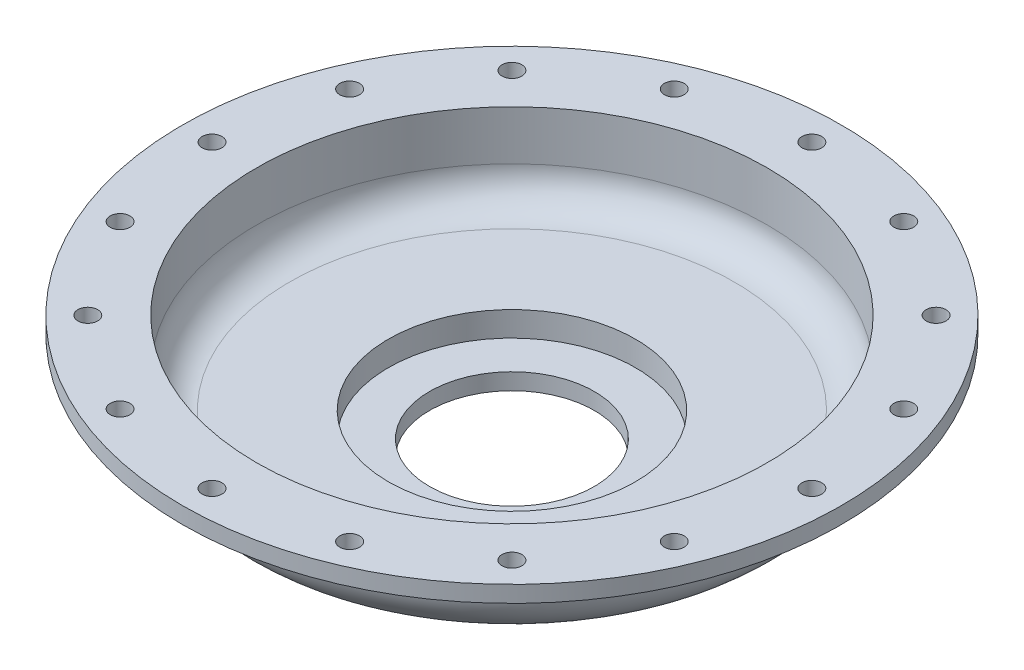
ISO-10303-21;
HEADER;
FILE_DESCRIPTION(('STEP AP214'),'2;1');
FILE_NAME('part.step','',(''),(''),'','','');
FILE_SCHEMA(('AUTOMOTIVE_DESIGN { 1 0 10303 214 1 1 1 1 }'));
ENDSEC;
DATA;
#1=APPLICATION_CONTEXT('core data for automotive mechanical design processes');
#2=APPLICATION_PROTOCOL_DEFINITION('international standard','automotive_design',2000,#1);
#3=PRODUCT_CONTEXT('',#1,'mechanical');
#4=PRODUCT('Part','Part','',(#3));
#5=PRODUCT_RELATED_PRODUCT_CATEGORY('part','',(#4));
#6=PRODUCT_DEFINITION_FORMATION('','',#4);
#7=PRODUCT_DEFINITION_CONTEXT('part definition',#1,'design');
#8=PRODUCT_DEFINITION('design','',#6,#7);
#9=PRODUCT_DEFINITION_SHAPE('','',#8);
#10=(LENGTH_UNIT() NAMED_UNIT(*) SI_UNIT(.MILLI.,.METRE.));
#11=(NAMED_UNIT(*) PLANE_ANGLE_UNIT() SI_UNIT($,.RADIAN.));
#12=(NAMED_UNIT(*) SI_UNIT($,.STERADIAN.) SOLID_ANGLE_UNIT());
#13=UNCERTAINTY_MEASURE_WITH_UNIT(LENGTH_MEASURE(1.E-05),#10,'distance_accuracy_value','');
#14=(GEOMETRIC_REPRESENTATION_CONTEXT(3) GLOBAL_UNCERTAINTY_ASSIGNED_CONTEXT((#13)) GLOBAL_UNIT_ASSIGNED_CONTEXT((#10,
#11,#12)) REPRESENTATION_CONTEXT('',''));
#15=CARTESIAN_POINT('',(0.,0.,0.));
#16=DIRECTION('',(0.,0.,1.));
#17=DIRECTION('',(1.,0.,0.));
#18=AXIS2_PLACEMENT_3D('',#15,#16,#17);
#19=CARTESIAN_POINT('',(0.,15.,0.));
#20=DIRECTION('',(0.,1.,0.));
#21=DIRECTION('',(0.,0.,1.));
#22=AXIS2_PLACEMENT_3D('',#19,#20,#21);
#23=CYLINDRICAL_SURFACE('',#22,165.);
#24=CARTESIAN_POINT('',(0.,45.,0.));
#25=DIRECTION('',(0.,1.,0.));
#26=DIRECTION('',(0.,0.,1.));
#27=AXIS2_PLACEMENT_3D('',#24,#25,#26);
#28=CIRCLE('',#27,165.);
#29=CARTESIAN_POINT('',(0.,45.,165.));
#30=VERTEX_POINT('',#29);
#31=EDGE_CURVE('E49',#30,#30,#28,.T.);
#32=ORIENTED_EDGE('',*,*,#31,.T.);
#33=EDGE_LOOP('',(#32));
#34=FACE_BOUND('',#33,.T.);
#35=CARTESIAN_POINT('',(0.,65.,0.));
#36=DIRECTION('',(0.,1.,0.));
#37=DIRECTION('',(0.,0.,1.));
#38=AXIS2_PLACEMENT_3D('',#35,#36,#37);
#39=CIRCLE('',#38,165.);
#40=CARTESIAN_POINT('',(0.,65.,165.));
#41=VERTEX_POINT('',#40);
#42=EDGE_CURVE('E58',#41,#41,#39,.T.);
#43=ORIENTED_EDGE('',*,*,#42,.F.);
#44=EDGE_LOOP('',(#43));
#45=FACE_BOUND('',#44,.T.);
#46=ADVANCED_FACE('F37',(#34,#45),#23,.T.);
#47=CARTESIAN_POINT('',(0.,15.,0.));
#48=DIRECTION('',(0.,1.,0.));
#49=DIRECTION('',(0.,0.,1.));
#50=AXIS2_PLACEMENT_3D('',#47,#48,#49);
#51=PLANE('',#50);
#52=CARTESIAN_POINT('',(0.,15.,0.));
#53=DIRECTION('',(0.,1.,0.));
#54=DIRECTION('',(0.,0.,1.));
#55=AXIS2_PLACEMENT_3D('',#52,#53,#54);
#56=CIRCLE('',#55,85.);
#57=CARTESIAN_POINT('',(0.,15.,85.));
#58=VERTEX_POINT('',#57);
#59=EDGE_CURVE('E10',#58,#58,#56,.F.);
#60=ORIENTED_EDGE('',*,*,#59,.F.);
#61=EDGE_LOOP('',(#60));
#62=FACE_BOUND('',#61,.T.);
#63=CARTESIAN_POINT('',(0.,15.,0.));
#64=DIRECTION('',(0.,1.,0.));
#65=DIRECTION('',(0.,0.,1.));
#66=AXIS2_PLACEMENT_3D('',#63,#64,#65);
#67=CIRCLE('',#66,135.);
#68=CARTESIAN_POINT('',(0.,15.,135.));
#69=VERTEX_POINT('',#68);
#70=EDGE_CURVE('E45',#69,#69,#67,.F.);
#71=ORIENTED_EDGE('',*,*,#70,.T.);
#72=EDGE_LOOP('',(#71));
#73=FACE_BOUND('',#72,.T.);
#74=ADVANCED_FACE('F225',(#62,#73),#51,.F.);
#75=CARTESIAN_POINT('',(0.,65.,0.));
#76=DIRECTION('',(0.,1.,0.));
#77=DIRECTION('',(0.,0.,1.));
#78=AXIS2_PLACEMENT_3D('',#75,#76,#77);
#79=CYLINDRICAL_SURFACE('',#78,200.);
#80=CARTESIAN_POINT('',(0.,65.,0.));
#81=DIRECTION('',(0.,1.,0.));
#82=DIRECTION('',(0.,0.,1.));
#83=AXIS2_PLACEMENT_3D('',#80,#81,#82);
#84=CIRCLE('',#83,200.);
#85=CARTESIAN_POINT('',(0.,65.,200.));
#86=VERTEX_POINT('',#85);
#87=EDGE_CURVE('E54',#86,#86,#84,.T.);
#88=ORIENTED_EDGE('',*,*,#87,.T.);
#89=EDGE_LOOP('',(#88));
#90=FACE_BOUND('',#89,.T.);
#91=CARTESIAN_POINT('',(0.,75.,0.));
#92=DIRECTION('',(0.,1.,0.));
#93=DIRECTION('',(0.,0.,1.));
#94=AXIS2_PLACEMENT_3D('',#91,#92,#93);
#95=CIRCLE('',#94,200.);
#96=CARTESIAN_POINT('',(0.,75.,200.));
#97=VERTEX_POINT('',#96);
#98=EDGE_CURVE('E55',#97,#97,#95,.T.);
#99=ORIENTED_EDGE('',*,*,#98,.F.);
#100=EDGE_LOOP('',(#99));
#101=FACE_BOUND('',#100,.T.);
#102=ADVANCED_FACE('F222',(#90,#101),#79,.T.);
#103=CARTESIAN_POINT('',(0.,65.,0.));
#104=DIRECTION('',(0.,1.,0.));
#105=DIRECTION('',(0.,0.,1.));
#106=AXIS2_PLACEMENT_3D('',#103,#104,#105);
#107=PLANE('',#106);
#108=CARTESIAN_POINT('',(-69.6483846904441,65.,-168.146074917055));
#109=DIRECTION('',(0.,1.,0.));
#110=DIRECTION('',(0.,0.,1.));
#111=AXIS2_PLACEMENT_3D('',#108,#109,#110);
#112=CIRCLE('',#111,6.00000000000002);
#113=CARTESIAN_POINT('',(-69.6483846904441,65.,-162.146074917055));
#114=VERTEX_POINT('',#113);
#115=EDGE_CURVE('E151',#114,#114,#112,.T.);
#116=ORIENTED_EDGE('',*,*,#115,.T.);
#117=EDGE_LOOP('',(#116));
#118=FACE_BOUND('',#117,.T.);
#119=CARTESIAN_POINT('',(-128.693434175949,65.,-128.693434175946));
#120=DIRECTION('',(0.,1.,0.));
#121=DIRECTION('',(0.,0.,1.));
#122=AXIS2_PLACEMENT_3D('',#119,#120,#121);
#123=CIRCLE('',#122,6.00000000000597);
#124=CARTESIAN_POINT('',(-128.693434175949,65.,-122.69343417594));
#125=VERTEX_POINT('',#124);
#126=EDGE_CURVE('E145',#125,#125,#123,.T.);
#127=ORIENTED_EDGE('',*,*,#126,.T.);
#128=EDGE_LOOP('',(#127));
#129=FACE_BOUND('',#128,.T.);
#130=CARTESIAN_POINT('',(-168.146074917049,65.,-69.6483846904393));
#131=DIRECTION('',(0.,1.,0.));
#132=DIRECTION('',(0.,0.,1.));
#133=AXIS2_PLACEMENT_3D('',#130,#131,#132);
#134=CIRCLE('',#133,6.00000000000849);
#135=CARTESIAN_POINT('',(-168.146074917049,65.,-63.6483846904308));
#136=VERTEX_POINT('',#135);
#137=EDGE_CURVE('E139',#136,#136,#134,.T.);
#138=ORIENTED_EDGE('',*,*,#137,.T.);
#139=EDGE_LOOP('',(#138));
#140=FACE_BOUND('',#139,.T.);
#141=CARTESIAN_POINT('',(-181.999999999992,65.,7.74798238862805E-12));
#142=DIRECTION('',(0.,1.,0.));
#143=DIRECTION('',(0.,0.,1.));
#144=AXIS2_PLACEMENT_3D('',#141,#142,#143);
#145=CIRCLE('',#144,6.0000000000115);
#146=CARTESIAN_POINT('',(-181.999999999992,65.,6.00000000001925));
#147=VERTEX_POINT('',#146);
#148=EDGE_CURVE('E133',#147,#147,#145,.T.);
#149=ORIENTED_EDGE('',*,*,#148,.T.);
#150=EDGE_LOOP('',(#149));
#151=FACE_BOUND('',#150,.T.);
#152=CARTESIAN_POINT('',(-168.146074917043,65.,69.6483846904536));
#153=DIRECTION('',(0.,1.,0.));
#154=DIRECTION('',(0.,0.,1.));
#155=AXIS2_PLACEMENT_3D('',#152,#153,#154);
#156=CIRCLE('',#155,6.00000000001415);
#157=CARTESIAN_POINT('',(-168.146074917043,65.,75.6483846904677));
#158=VERTEX_POINT('',#157);
#159=EDGE_CURVE('E127',#158,#158,#156,.T.);
#160=ORIENTED_EDGE('',*,*,#159,.T.);
#161=EDGE_LOOP('',(#160));
#162=FACE_BOUND('',#161,.T.);
#163=CARTESIAN_POINT('',(-128.693434175938,65.,128.693434175957));
#164=DIRECTION('',(0.,1.,0.));
#165=DIRECTION('',(0.,0.,1.));
#166=AXIS2_PLACEMENT_3D('',#163,#164,#165);
#167=CIRCLE('',#166,6.00000000001573);
#168=CARTESIAN_POINT('',(-128.693434175938,65.,134.693434175973));
#169=VERTEX_POINT('',#168);
#170=EDGE_CURVE('E121',#169,#169,#167,.T.);
#171=ORIENTED_EDGE('',*,*,#170,.T.);
#172=EDGE_LOOP('',(#171));
#173=FACE_BOUND('',#172,.T.);
#174=CARTESIAN_POINT('',(-69.6483846904315,65.,168.146074917057));
#175=DIRECTION('',(0.,1.,0.));
#176=DIRECTION('',(0.,0.,1.));
#177=AXIS2_PLACEMENT_3D('',#174,#175,#176);
#178=CIRCLE('',#177,6.00000000001644);
#179=CARTESIAN_POINT('',(-69.6483846904315,65.,174.146074917074));
#180=VERTEX_POINT('',#179);
#181=EDGE_CURVE('E115',#180,#180,#178,.T.);
#182=ORIENTED_EDGE('',*,*,#181,.T.);
#183=EDGE_LOOP('',(#182));
#184=FACE_BOUND('',#183,.T.);
#185=CARTESIAN_POINT('',(1.54513876337671E-11,65.,182.));
#186=DIRECTION('',(0.,1.,0.));
#187=DIRECTION('',(0.,0.,1.));
#188=AXIS2_PLACEMENT_3D('',#185,#186,#187);
#189=CIRCLE('',#188,6.000000000016);
#190=CARTESIAN_POINT('',(1.54513876337671E-11,65.,188.000000000016));
#191=VERTEX_POINT('',#190);
#192=EDGE_CURVE('E109',#191,#191,#189,.T.);
#193=ORIENTED_EDGE('',*,*,#192,.T.);
#194=EDGE_LOOP('',(#193));
#195=FACE_BOUND('',#194,.T.);
#196=CARTESIAN_POINT('',(69.6483846904612,65.,168.146074917051));
#197=DIRECTION('',(0.,1.,0.));
#198=DIRECTION('',(0.,0.,1.));
#199=AXIS2_PLACEMENT_3D('',#196,#197,#198);
#200=CIRCLE('',#199,6.00000000001445);
#201=CARTESIAN_POINT('',(69.6483846904612,65.,174.146074917066));
#202=VERTEX_POINT('',#201);
#203=EDGE_CURVE('E103',#202,#202,#200,.T.);
#204=ORIENTED_EDGE('',*,*,#203,.T.);
#205=EDGE_LOOP('',(#204));
#206=FACE_BOUND('',#205,.T.);
#207=CARTESIAN_POINT('',(128.693434175965,65.,128.693434175946));
#208=DIRECTION('',(0.,1.,0.));
#209=DIRECTION('',(0.,0.,1.));
#210=AXIS2_PLACEMENT_3D('',#207,#208,#209);
#211=CIRCLE('',#210,6.00000000001194);
#212=CARTESIAN_POINT('',(128.693434175965,65.,134.693434175958));
#213=VERTEX_POINT('',#212);
#214=EDGE_CURVE('E97',#213,#213,#211,.T.);
#215=ORIENTED_EDGE('',*,*,#214,.T.);
#216=EDGE_LOOP('',(#215));
#217=FACE_BOUND('',#216,.T.);
#218=CARTESIAN_POINT('',(168.146074917065,65.,69.6483846904392));
#219=DIRECTION('',(0.,1.,0.));
#220=DIRECTION('',(0.,0.,1.));
#221=AXIS2_PLACEMENT_3D('',#218,#219,#220);
#222=CIRCLE('',#221,6.00000000000888);
#223=CARTESIAN_POINT('',(168.146074917065,65.,75.6483846904481));
#224=VERTEX_POINT('',#223);
#225=EDGE_CURVE('E91',#224,#224,#222,.T.);
#226=ORIENTED_EDGE('',*,*,#225,.T.);
#227=EDGE_LOOP('',(#226));
#228=FACE_BOUND('',#227,.T.);
#229=CARTESIAN_POINT('',(182.000000000008,65.,-7.72569381688357E-12));
#230=DIRECTION('',(0.,1.,0.));
#231=DIRECTION('',(0.,0.,1.));
#232=AXIS2_PLACEMENT_3D('',#229,#230,#231);
#233=CIRCLE('',#232,6.00000000000574);
#234=CARTESIAN_POINT('',(182.000000000008,65.,5.99999999999801));
#235=VERTEX_POINT('',#234);
#236=EDGE_CURVE('E85',#235,#235,#233,.T.);
#237=ORIENTED_EDGE('',*,*,#236,.T.);
#238=EDGE_LOOP('',(#237));
#239=FACE_BOUND('',#238,.T.);
#240=CARTESIAN_POINT('',(168.146074917059,65.,-69.6483846904535));
#241=DIRECTION('',(0.,1.,0.));
#242=DIRECTION('',(0.,0.,1.));
#243=AXIS2_PLACEMENT_3D('',#240,#241,#242);
#244=CIRCLE('',#243,6.00000000000295);
#245=CARTESIAN_POINT('',(168.146074917059,65.,-63.6483846904505));
#246=VERTEX_POINT('',#245);
#247=EDGE_CURVE('E79',#246,#246,#244,.T.);
#248=ORIENTED_EDGE('',*,*,#247,.T.);
#249=EDGE_LOOP('',(#248));
#250=FACE_BOUND('',#249,.T.);
#251=CARTESIAN_POINT('',(128.693434175954,65.,-128.693434175957));
#252=DIRECTION('',(0.,1.,0.));
#253=DIRECTION('',(0.,0.,1.));
#254=AXIS2_PLACEMENT_3D('',#251,#252,#253);
#255=CIRCLE('',#254,6.00000000000089);
#256=CARTESIAN_POINT('',(128.693434175954,65.,-122.693434175956));
#257=VERTEX_POINT('',#256);
#258=EDGE_CURVE('E73',#257,#257,#255,.T.);
#259=ORIENTED_EDGE('',*,*,#258,.T.);
#260=EDGE_LOOP('',(#259));
#261=FACE_BOUND('',#260,.T.);
#262=CARTESIAN_POINT('',(69.6483846904465,65.,-168.146074917054));
#263=DIRECTION('',(0.,1.,0.));
#264=DIRECTION('',(0.,0.,1.));
#265=AXIS2_PLACEMENT_3D('',#262,#263,#264);
#266=CIRCLE('',#265,6.);
#267=CARTESIAN_POINT('',(69.6483846904465,65.,-162.146074917054));
#268=VERTEX_POINT('',#267);
#269=EDGE_CURVE('E67',#268,#268,#266,.T.);
#270=ORIENTED_EDGE('',*,*,#269,.T.);
#271=EDGE_LOOP('',(#270));
#272=FACE_BOUND('',#271,.T.);
#273=CARTESIAN_POINT('',(0.,65.,-182.));
#274=DIRECTION('',(0.,1.,0.));
#275=DIRECTION('',(0.,0.,1.));
#276=AXIS2_PLACEMENT_3D('',#273,#274,#275);
#277=CIRCLE('',#276,6.);
#278=CARTESIAN_POINT('',(0.,65.,-176.));
#279=VERTEX_POINT('',#278);
#280=EDGE_CURVE('E63',#279,#279,#277,.T.);
#281=ORIENTED_EDGE('',*,*,#280,.T.);
#282=EDGE_LOOP('',(#281));
#283=FACE_BOUND('',#282,.T.);
#284=ORIENTED_EDGE('',*,*,#42,.T.);
#285=EDGE_LOOP('',(#284));
#286=FACE_BOUND('',#285,.T.);
#287=ORIENTED_EDGE('',*,*,#87,.F.);
#288=EDGE_LOOP('',(#287));
#289=FACE_BOUND('',#288,.T.);
#290=ADVANCED_FACE('F224',(#118,#129,#140,#151,#162,#173,#184,#195,#206,#217,#228,#239,#250,
#261,#272,#283,#286,#289),#107,.F.);
#291=CARTESIAN_POINT('',(0.,65.,-182.));
#292=DIRECTION('',(0.,1.,0.));
#293=DIRECTION('',(0.,0.,1.));
#294=AXIS2_PLACEMENT_3D('',#291,#292,#293);
#295=CYLINDRICAL_SURFACE('',#294,6.);
#296=ORIENTED_EDGE('',*,*,#280,.F.);
#297=EDGE_LOOP('',(#296));
#298=FACE_BOUND('',#297,.T.);
#299=CARTESIAN_POINT('',(0.,75.,-182.));
#300=DIRECTION('',(0.,1.,0.));
#301=DIRECTION('',(0.,0.,1.));
#302=AXIS2_PLACEMENT_3D('',#299,#300,#301);
#303=CIRCLE('',#302,6.);
#304=CARTESIAN_POINT('',(0.,75.,-176.));
#305=VERTEX_POINT('',#304);
#306=EDGE_CURVE('E64',#305,#305,#303,.T.);
#307=ORIENTED_EDGE('',*,*,#306,.T.);
#308=EDGE_LOOP('',(#307));
#309=FACE_BOUND('',#308,.T.);
#310=ADVANCED_FACE('F232',(#298,#309),#295,.F.);
#311=CARTESIAN_POINT('',(69.6483846904465,65.,-168.146074917054));
#312=DIRECTION('',(0.,1.,0.));
#313=DIRECTION('',(0.,0.,1.));
#314=AXIS2_PLACEMENT_3D('',#311,#312,#313);
#315=CYLINDRICAL_SURFACE('',#314,6.);
#316=ORIENTED_EDGE('',*,*,#269,.F.);
#317=EDGE_LOOP('',(#316));
#318=FACE_BOUND('',#317,.T.);
#319=CARTESIAN_POINT('',(69.6483846904465,75.,-168.146074917054));
#320=DIRECTION('',(0.,1.,0.));
#321=DIRECTION('',(0.,0.,1.));
#322=AXIS2_PLACEMENT_3D('',#319,#320,#321);
#323=CIRCLE('',#322,6.);
#324=CARTESIAN_POINT('',(69.6483846904465,75.,-162.146074917054));
#325=VERTEX_POINT('',#324);
#326=EDGE_CURVE('E70',#325,#325,#323,.T.);
#327=ORIENTED_EDGE('',*,*,#326,.T.);
#328=EDGE_LOOP('',(#327));
#329=FACE_BOUND('',#328,.T.);
#330=ADVANCED_FACE('F321',(#318,#329),#315,.F.);
#331=CARTESIAN_POINT('',(128.693434175954,65.,-128.693434175957));
#332=DIRECTION('',(0.,1.,0.));
#333=DIRECTION('',(0.,0.,1.));
#334=AXIS2_PLACEMENT_3D('',#331,#332,#333);
#335=CYLINDRICAL_SURFACE('',#334,6.00000000000089);
#336=ORIENTED_EDGE('',*,*,#258,.F.);
#337=EDGE_LOOP('',(#336));
#338=FACE_BOUND('',#337,.T.);
#339=CARTESIAN_POINT('',(128.693434175954,75.,-128.693434175957));
#340=DIRECTION('',(0.,1.,0.));
#341=DIRECTION('',(0.,0.,1.));
#342=AXIS2_PLACEMENT_3D('',#339,#340,#341);
#343=CIRCLE('',#342,6.00000000000089);
#344=CARTESIAN_POINT('',(128.693434175954,75.,-122.693434175956));
#345=VERTEX_POINT('',#344);
#346=EDGE_CURVE('E76',#345,#345,#343,.T.);
#347=ORIENTED_EDGE('',*,*,#346,.T.);
#348=EDGE_LOOP('',(#347));
#349=FACE_BOUND('',#348,.T.);
#350=ADVANCED_FACE('F317',(#338,#349),#335,.F.);
#351=CARTESIAN_POINT('',(168.146074917059,65.,-69.6483846904535));
#352=DIRECTION('',(0.,1.,0.));
#353=DIRECTION('',(0.,0.,1.));
#354=AXIS2_PLACEMENT_3D('',#351,#352,#353);
#355=CYLINDRICAL_SURFACE('',#354,6.00000000000295);
#356=ORIENTED_EDGE('',*,*,#247,.F.);
#357=EDGE_LOOP('',(#356));
#358=FACE_BOUND('',#357,.T.);
#359=CARTESIAN_POINT('',(168.146074917059,75.,-69.6483846904535));
#360=DIRECTION('',(0.,1.,0.));
#361=DIRECTION('',(0.,0.,1.));
#362=AXIS2_PLACEMENT_3D('',#359,#360,#361);
#363=CIRCLE('',#362,6.00000000000295);
#364=CARTESIAN_POINT('',(168.146074917059,75.,-63.6483846904505));
#365=VERTEX_POINT('',#364);
#366=EDGE_CURVE('E82',#365,#365,#363,.T.);
#367=ORIENTED_EDGE('',*,*,#366,.T.);
#368=EDGE_LOOP('',(#367));
#369=FACE_BOUND('',#368,.T.);
#370=ADVANCED_FACE('F313',(#358,#369),#355,.F.);
#371=CARTESIAN_POINT('',(182.000000000008,65.,-7.72569381688357E-12));
#372=DIRECTION('',(0.,1.,0.));
#373=DIRECTION('',(0.,0.,1.));
#374=AXIS2_PLACEMENT_3D('',#371,#372,#373);
#375=CYLINDRICAL_SURFACE('',#374,6.00000000000574);
#376=ORIENTED_EDGE('',*,*,#236,.F.);
#377=EDGE_LOOP('',(#376));
#378=FACE_BOUND('',#377,.T.);
#379=CARTESIAN_POINT('',(182.000000000008,75.,-7.72569381688357E-12));
#380=DIRECTION('',(0.,1.,0.));
#381=DIRECTION('',(0.,0.,1.));
#382=AXIS2_PLACEMENT_3D('',#379,#380,#381);
#383=CIRCLE('',#382,6.00000000000574);
#384=CARTESIAN_POINT('',(182.000000000008,75.,5.99999999999801));
#385=VERTEX_POINT('',#384);
#386=EDGE_CURVE('E88',#385,#385,#383,.T.);
#387=ORIENTED_EDGE('',*,*,#386,.T.);
#388=EDGE_LOOP('',(#387));
#389=FACE_BOUND('',#388,.T.);
#390=ADVANCED_FACE('F309',(#378,#389),#375,.F.);
#391=CARTESIAN_POINT('',(168.146074917065,65.,69.6483846904392));
#392=DIRECTION('',(0.,1.,0.));
#393=DIRECTION('',(0.,0.,1.));
#394=AXIS2_PLACEMENT_3D('',#391,#392,#393);
#395=CYLINDRICAL_SURFACE('',#394,6.00000000000888);
#396=ORIENTED_EDGE('',*,*,#225,.F.);
#397=EDGE_LOOP('',(#396));
#398=FACE_BOUND('',#397,.T.);
#399=CARTESIAN_POINT('',(168.146074917065,75.,69.6483846904392));
#400=DIRECTION('',(0.,1.,0.));
#401=DIRECTION('',(0.,0.,1.));
#402=AXIS2_PLACEMENT_3D('',#399,#400,#401);
#403=CIRCLE('',#402,6.00000000000888);
#404=CARTESIAN_POINT('',(168.146074917065,75.,75.6483846904481));
#405=VERTEX_POINT('',#404);
#406=EDGE_CURVE('E94',#405,#405,#403,.T.);
#407=ORIENTED_EDGE('',*,*,#406,.T.);
#408=EDGE_LOOP('',(#407));
#409=FACE_BOUND('',#408,.T.);
#410=ADVANCED_FACE('F305',(#398,#409),#395,.F.);
#411=CARTESIAN_POINT('',(128.693434175965,65.,128.693434175946));
#412=DIRECTION('',(0.,1.,0.));
#413=DIRECTION('',(0.,0.,1.));
#414=AXIS2_PLACEMENT_3D('',#411,#412,#413);
#415=CYLINDRICAL_SURFACE('',#414,6.00000000001194);
#416=ORIENTED_EDGE('',*,*,#214,.F.);
#417=EDGE_LOOP('',(#416));
#418=FACE_BOUND('',#417,.T.);
#419=CARTESIAN_POINT('',(128.693434175965,75.,128.693434175946));
#420=DIRECTION('',(0.,1.,0.));
#421=DIRECTION('',(0.,0.,1.));
#422=AXIS2_PLACEMENT_3D('',#419,#420,#421);
#423=CIRCLE('',#422,6.00000000001194);
#424=CARTESIAN_POINT('',(128.693434175965,75.,134.693434175958));
#425=VERTEX_POINT('',#424);
#426=EDGE_CURVE('E100',#425,#425,#423,.T.);
#427=ORIENTED_EDGE('',*,*,#426,.T.);
#428=EDGE_LOOP('',(#427));
#429=FACE_BOUND('',#428,.T.);
#430=ADVANCED_FACE('F301',(#418,#429),#415,.F.);
#431=CARTESIAN_POINT('',(69.6483846904612,65.,168.146074917051));
#432=DIRECTION('',(0.,1.,0.));
#433=DIRECTION('',(0.,0.,1.));
#434=AXIS2_PLACEMENT_3D('',#431,#432,#433);
#435=CYLINDRICAL_SURFACE('',#434,6.00000000001445);
#436=ORIENTED_EDGE('',*,*,#203,.F.);
#437=EDGE_LOOP('',(#436));
#438=FACE_BOUND('',#437,.T.);
#439=CARTESIAN_POINT('',(69.6483846904612,75.,168.146074917051));
#440=DIRECTION('',(0.,1.,0.));
#441=DIRECTION('',(0.,0.,1.));
#442=AXIS2_PLACEMENT_3D('',#439,#440,#441);
#443=CIRCLE('',#442,6.00000000001445);
#444=CARTESIAN_POINT('',(69.6483846904612,75.,174.146074917066));
#445=VERTEX_POINT('',#444);
#446=EDGE_CURVE('E106',#445,#445,#443,.T.);
#447=ORIENTED_EDGE('',*,*,#446,.T.);
#448=EDGE_LOOP('',(#447));
#449=FACE_BOUND('',#448,.T.);
#450=ADVANCED_FACE('F297',(#438,#449),#435,.F.);
#451=CARTESIAN_POINT('',(1.54513876337671E-11,65.,182.));
#452=DIRECTION('',(0.,1.,0.));
#453=DIRECTION('',(0.,0.,1.));
#454=AXIS2_PLACEMENT_3D('',#451,#452,#453);
#455=CYLINDRICAL_SURFACE('',#454,6.000000000016);
#456=ORIENTED_EDGE('',*,*,#192,.F.);
#457=EDGE_LOOP('',(#456));
#458=FACE_BOUND('',#457,.T.);
#459=CARTESIAN_POINT('',(1.54513876337671E-11,75.,182.));
#460=DIRECTION('',(0.,1.,0.));
#461=DIRECTION('',(0.,0.,1.));
#462=AXIS2_PLACEMENT_3D('',#459,#460,#461);
#463=CIRCLE('',#462,6.000000000016);
#464=CARTESIAN_POINT('',(1.54513876337671E-11,75.,188.000000000016));
#465=VERTEX_POINT('',#464);
#466=EDGE_CURVE('E112',#465,#465,#463,.T.);
#467=ORIENTED_EDGE('',*,*,#466,.T.);
#468=EDGE_LOOP('',(#467));
#469=FACE_BOUND('',#468,.T.);
#470=ADVANCED_FACE('F293',(#458,#469),#455,.F.);
#471=CARTESIAN_POINT('',(-69.6483846904315,65.,168.146074917057));
#472=DIRECTION('',(0.,1.,0.));
#473=DIRECTION('',(0.,0.,1.));
#474=AXIS2_PLACEMENT_3D('',#471,#472,#473);
#475=CYLINDRICAL_SURFACE('',#474,6.00000000001644);
#476=ORIENTED_EDGE('',*,*,#181,.F.);
#477=EDGE_LOOP('',(#476));
#478=FACE_BOUND('',#477,.T.);
#479=CARTESIAN_POINT('',(-69.6483846904315,75.,168.146074917057));
#480=DIRECTION('',(0.,1.,0.));
#481=DIRECTION('',(0.,0.,1.));
#482=AXIS2_PLACEMENT_3D('',#479,#480,#481);
#483=CIRCLE('',#482,6.00000000001644);
#484=CARTESIAN_POINT('',(-69.6483846904315,75.,174.146074917074));
#485=VERTEX_POINT('',#484);
#486=EDGE_CURVE('E118',#485,#485,#483,.T.);
#487=ORIENTED_EDGE('',*,*,#486,.T.);
#488=EDGE_LOOP('',(#487));
#489=FACE_BOUND('',#488,.T.);
#490=ADVANCED_FACE('F289',(#478,#489),#475,.F.);
#491=CARTESIAN_POINT('',(-128.693434175938,65.,128.693434175957));
#492=DIRECTION('',(0.,1.,0.));
#493=DIRECTION('',(0.,0.,1.));
#494=AXIS2_PLACEMENT_3D('',#491,#492,#493);
#495=CYLINDRICAL_SURFACE('',#494,6.00000000001573);
#496=ORIENTED_EDGE('',*,*,#170,.F.);
#497=EDGE_LOOP('',(#496));
#498=FACE_BOUND('',#497,.T.);
#499=CARTESIAN_POINT('',(-128.693434175938,75.,128.693434175957));
#500=DIRECTION('',(0.,1.,0.));
#501=DIRECTION('',(0.,0.,1.));
#502=AXIS2_PLACEMENT_3D('',#499,#500,#501);
#503=CIRCLE('',#502,6.00000000001573);
#504=CARTESIAN_POINT('',(-128.693434175938,75.,134.693434175973));
#505=VERTEX_POINT('',#504);
#506=EDGE_CURVE('E124',#505,#505,#503,.T.);
#507=ORIENTED_EDGE('',*,*,#506,.T.);
#508=EDGE_LOOP('',(#507));
#509=FACE_BOUND('',#508,.T.);
#510=ADVANCED_FACE('F285',(#498,#509),#495,.F.);
#511=CARTESIAN_POINT('',(-168.146074917043,65.,69.6483846904536));
#512=DIRECTION('',(0.,1.,0.));
#513=DIRECTION('',(0.,0.,1.));
#514=AXIS2_PLACEMENT_3D('',#511,#512,#513);
#515=CYLINDRICAL_SURFACE('',#514,6.00000000001415);
#516=ORIENTED_EDGE('',*,*,#159,.F.);
#517=EDGE_LOOP('',(#516));
#518=FACE_BOUND('',#517,.T.);
#519=CARTESIAN_POINT('',(-168.146074917043,75.,69.6483846904536));
#520=DIRECTION('',(0.,1.,0.));
#521=DIRECTION('',(0.,0.,1.));
#522=AXIS2_PLACEMENT_3D('',#519,#520,#521);
#523=CIRCLE('',#522,6.00000000001415);
#524=CARTESIAN_POINT('',(-168.146074917043,75.,75.6483846904677));
#525=VERTEX_POINT('',#524);
#526=EDGE_CURVE('E130',#525,#525,#523,.T.);
#527=ORIENTED_EDGE('',*,*,#526,.T.);
#528=EDGE_LOOP('',(#527));
#529=FACE_BOUND('',#528,.T.);
#530=ADVANCED_FACE('F281',(#518,#529),#515,.F.);
#531=CARTESIAN_POINT('',(-181.999999999992,65.,7.74798238862805E-12));
#532=DIRECTION('',(0.,1.,0.));
#533=DIRECTION('',(0.,0.,1.));
#534=AXIS2_PLACEMENT_3D('',#531,#532,#533);
#535=CYLINDRICAL_SURFACE('',#534,6.0000000000115);
#536=ORIENTED_EDGE('',*,*,#148,.F.);
#537=EDGE_LOOP('',(#536));
#538=FACE_BOUND('',#537,.T.);
#539=CARTESIAN_POINT('',(-181.999999999992,75.,7.74798238862805E-12));
#540=DIRECTION('',(0.,1.,0.));
#541=DIRECTION('',(0.,0.,1.));
#542=AXIS2_PLACEMENT_3D('',#539,#540,#541);
#543=CIRCLE('',#542,6.0000000000115);
#544=CARTESIAN_POINT('',(-181.999999999992,75.,6.00000000001925));
#545=VERTEX_POINT('',#544);
#546=EDGE_CURVE('E136',#545,#545,#543,.T.);
#547=ORIENTED_EDGE('',*,*,#546,.T.);
#548=EDGE_LOOP('',(#547));
#549=FACE_BOUND('',#548,.T.);
#550=ADVANCED_FACE('F277',(#538,#549),#535,.F.);
#551=CARTESIAN_POINT('',(-168.146074917049,65.,-69.6483846904393));
#552=DIRECTION('',(0.,1.,0.));
#553=DIRECTION('',(0.,0.,1.));
#554=AXIS2_PLACEMENT_3D('',#551,#552,#553);
#555=CYLINDRICAL_SURFACE('',#554,6.00000000000849);
#556=ORIENTED_EDGE('',*,*,#137,.F.);
#557=EDGE_LOOP('',(#556));
#558=FACE_BOUND('',#557,.T.);
#559=CARTESIAN_POINT('',(-168.146074917049,75.,-69.6483846904393));
#560=DIRECTION('',(0.,1.,0.));
#561=DIRECTION('',(0.,0.,1.));
#562=AXIS2_PLACEMENT_3D('',#559,#560,#561);
#563=CIRCLE('',#562,6.00000000000849);
#564=CARTESIAN_POINT('',(-168.146074917049,75.,-63.6483846904308));
#565=VERTEX_POINT('',#564);
#566=EDGE_CURVE('E142',#565,#565,#563,.T.);
#567=ORIENTED_EDGE('',*,*,#566,.T.);
#568=EDGE_LOOP('',(#567));
#569=FACE_BOUND('',#568,.T.);
#570=ADVANCED_FACE('F273',(#558,#569),#555,.F.);
#571=CARTESIAN_POINT('',(-128.693434175949,65.,-128.693434175946));
#572=DIRECTION('',(0.,1.,0.));
#573=DIRECTION('',(0.,0.,1.));
#574=AXIS2_PLACEMENT_3D('',#571,#572,#573);
#575=CYLINDRICAL_SURFACE('',#574,6.00000000000597);
#576=ORIENTED_EDGE('',*,*,#126,.F.);
#577=EDGE_LOOP('',(#576));
#578=FACE_BOUND('',#577,.T.);
#579=CARTESIAN_POINT('',(-128.693434175949,75.,-128.693434175946));
#580=DIRECTION('',(0.,1.,0.));
#581=DIRECTION('',(0.,0.,1.));
#582=AXIS2_PLACEMENT_3D('',#579,#580,#581);
#583=CIRCLE('',#582,6.00000000000597);
#584=CARTESIAN_POINT('',(-128.693434175949,75.,-122.69343417594));
#585=VERTEX_POINT('',#584);
#586=EDGE_CURVE('E148',#585,#585,#583,.T.);
#587=ORIENTED_EDGE('',*,*,#586,.T.);
#588=EDGE_LOOP('',(#587));
#589=FACE_BOUND('',#588,.T.);
#590=ADVANCED_FACE('F269',(#578,#589),#575,.F.);
#591=CARTESIAN_POINT('',(-69.6483846904441,65.,-168.146074917055));
#592=DIRECTION('',(0.,1.,0.));
#593=DIRECTION('',(0.,0.,1.));
#594=AXIS2_PLACEMENT_3D('',#591,#592,#593);
#595=CYLINDRICAL_SURFACE('',#594,6.00000000000002);
#596=ORIENTED_EDGE('',*,*,#115,.F.);
#597=EDGE_LOOP('',(#596));
#598=FACE_BOUND('',#597,.T.);
#599=CARTESIAN_POINT('',(-69.6483846904441,75.,-168.146074917055));
#600=DIRECTION('',(0.,1.,0.));
#601=DIRECTION('',(0.,0.,1.));
#602=AXIS2_PLACEMENT_3D('',#599,#600,#601);
#603=CIRCLE('',#602,6.00000000000002);
#604=CARTESIAN_POINT('',(-69.6483846904441,75.,-162.146074917055));
#605=VERTEX_POINT('',#604);
#606=EDGE_CURVE('E154',#605,#605,#603,.T.);
#607=ORIENTED_EDGE('',*,*,#606,.T.);
#608=EDGE_LOOP('',(#607));
#609=FACE_BOUND('',#608,.T.);
#610=ADVANCED_FACE('F186',(#598,#609),#595,.F.);
#611=CARTESIAN_POINT('',(0.,75.,0.));
#612=DIRECTION('',(0.,1.,0.));
#613=DIRECTION('',(0.,0.,1.));
#614=AXIS2_PLACEMENT_3D('',#611,#612,#613);
#615=PLANE('',#614);
#616=CARTESIAN_POINT('',(0.,75.,0.));
#617=DIRECTION('',(0.,1.,0.));
#618=DIRECTION('',(0.,0.,1.));
#619=AXIS2_PLACEMENT_3D('',#616,#617,#618);
#620=CIRCLE('',#619,155.);
#621=CARTESIAN_POINT('',(0.,75.,155.));
#622=VERTEX_POINT('',#621);
#623=EDGE_CURVE('E166',#622,#622,#620,.T.);
#624=ORIENTED_EDGE('',*,*,#623,.F.);
#625=EDGE_LOOP('',(#624));
#626=FACE_BOUND('',#625,.T.);
#627=ORIENTED_EDGE('',*,*,#606,.F.);
#628=EDGE_LOOP('',(#627));
#629=FACE_BOUND('',#628,.T.);
#630=ORIENTED_EDGE('',*,*,#586,.F.);
#631=EDGE_LOOP('',(#630));
#632=FACE_BOUND('',#631,.T.);
#633=ORIENTED_EDGE('',*,*,#566,.F.);
#634=EDGE_LOOP('',(#633));
#635=FACE_BOUND('',#634,.T.);
#636=ORIENTED_EDGE('',*,*,#546,.F.);
#637=EDGE_LOOP('',(#636));
#638=FACE_BOUND('',#637,.T.);
#639=ORIENTED_EDGE('',*,*,#526,.F.);
#640=EDGE_LOOP('',(#639));
#641=FACE_BOUND('',#640,.T.);
#642=ORIENTED_EDGE('',*,*,#506,.F.);
#643=EDGE_LOOP('',(#642));
#644=FACE_BOUND('',#643,.T.);
#645=ORIENTED_EDGE('',*,*,#486,.F.);
#646=EDGE_LOOP('',(#645));
#647=FACE_BOUND('',#646,.T.);
#648=ORIENTED_EDGE('',*,*,#466,.F.);
#649=EDGE_LOOP('',(#648));
#650=FACE_BOUND('',#649,.T.);
#651=ORIENTED_EDGE('',*,*,#446,.F.);
#652=EDGE_LOOP('',(#651));
#653=FACE_BOUND('',#652,.T.);
#654=ORIENTED_EDGE('',*,*,#426,.F.);
#655=EDGE_LOOP('',(#654));
#656=FACE_BOUND('',#655,.T.);
#657=ORIENTED_EDGE('',*,*,#406,.F.);
#658=EDGE_LOOP('',(#657));
#659=FACE_BOUND('',#658,.T.);
#660=ORIENTED_EDGE('',*,*,#386,.F.);
#661=EDGE_LOOP('',(#660));
#662=FACE_BOUND('',#661,.T.);
#663=ORIENTED_EDGE('',*,*,#366,.F.);
#664=EDGE_LOOP('',(#663));
#665=FACE_BOUND('',#664,.T.);
#666=ORIENTED_EDGE('',*,*,#346,.F.);
#667=EDGE_LOOP('',(#666));
#668=FACE_BOUND('',#667,.T.);
#669=ORIENTED_EDGE('',*,*,#326,.F.);
#670=EDGE_LOOP('',(#669));
#671=FACE_BOUND('',#670,.T.);
#672=ORIENTED_EDGE('',*,*,#306,.F.);
#673=EDGE_LOOP('',(#672));
#674=FACE_BOUND('',#673,.T.);
#675=ORIENTED_EDGE('',*,*,#98,.T.);
#676=EDGE_LOOP('',(#675));
#677=FACE_BOUND('',#676,.T.);
#678=ADVANCED_FACE('F183',(#626,#629,#632,#635,#638,#641,#644,#647,#650,#653,#656,#659,#662,
#665,#668,#671,#674,#677),#615,.T.);
#679=CARTESIAN_POINT('',(0.,45.,0.));
#680=DIRECTION('',(0.,1.,0.));
#681=DIRECTION('',(0.,0.,1.));
#682=AXIS2_PLACEMENT_3D('',#679,#680,#681);
#683=TOROIDAL_SURFACE('',#682,135.,30.);
#684=ORIENTED_EDGE('',*,*,#70,.F.);
#685=EDGE_LOOP('',(#684));
#686=FACE_BOUND('',#685,.T.);
#687=ORIENTED_EDGE('',*,*,#31,.F.);
#688=EDGE_LOOP('',(#687));
#689=FACE_BOUND('',#688,.T.);
#690=ADVANCED_FACE('F39',(#686,#689),#683,.T.);
#691=CARTESIAN_POINT('',(0.,0.,0.));
#692=DIRECTION('',(0.,1.,0.));
#693=DIRECTION('',(0.,0.,1.));
#694=AXIS2_PLACEMENT_3D('',#691,#692,#693);
#695=CYLINDRICAL_SURFACE('',#694,85.);
#696=CARTESIAN_POINT('',(0.,0.,0.));
#697=DIRECTION('',(0.,-1.,0.));
#698=DIRECTION('',(0.,0.,-1.));
#699=AXIS2_PLACEMENT_3D('',#696,#697,#698);
#700=CIRCLE('',#699,85.);
#701=CARTESIAN_POINT('',(0.,0.,-85.));
#702=VERTEX_POINT('',#701);
#703=EDGE_CURVE('E157',#702,#702,#700,.T.);
#704=ORIENTED_EDGE('',*,*,#703,.F.);
#705=EDGE_LOOP('',(#704));
#706=FACE_BOUND('',#705,.T.);
#707=ORIENTED_EDGE('',*,*,#59,.T.);
#708=EDGE_LOOP('',(#707));
#709=FACE_BOUND('',#708,.T.);
#710=ADVANCED_FACE('F246',(#706,#709),#695,.T.);
#711=CARTESIAN_POINT('',(0.,0.,0.));
#712=DIRECTION('',(0.,1.,0.));
#713=DIRECTION('',(0.,0.,1.));
#714=AXIS2_PLACEMENT_3D('',#711,#712,#713);
#715=PLANE('',#714);
#716=CARTESIAN_POINT('',(0.,0.,0.));
#717=DIRECTION('',(0.,1.,0.));
#718=DIRECTION('',(0.,0.,1.));
#719=AXIS2_PLACEMENT_3D('',#716,#717,#718);
#720=CIRCLE('',#719,50.);
#721=CARTESIAN_POINT('',(0.,0.,50.));
#722=VERTEX_POINT('',#721);
#723=EDGE_CURVE('E41',#722,#722,#720,.T.);
#724=ORIENTED_EDGE('',*,*,#723,.T.);
#725=EDGE_LOOP('',(#724));
#726=FACE_BOUND('',#725,.T.);
#727=ORIENTED_EDGE('',*,*,#703,.T.);
#728=EDGE_LOOP('',(#727));
#729=FACE_BOUND('',#728,.T.);
#730=ADVANCED_FACE('F243',(#726,#729),#715,.F.);
#731=CARTESIAN_POINT('',(0.,75.,0.));
#732=DIRECTION('',(0.,-1.,0.));
#733=DIRECTION('',(0.,0.,-1.));
#734=AXIS2_PLACEMENT_3D('',#731,#732,#733);
#735=CYLINDRICAL_SURFACE('',#734,50.);
#736=CARTESIAN_POINT('',(0.,9.99999999999999,0.));
#737=DIRECTION('',(0.,1.,0.));
#738=DIRECTION('',(0.,0.,1.));
#739=AXIS2_PLACEMENT_3D('',#736,#737,#738);
#740=CIRCLE('',#739,50.);
#741=CARTESIAN_POINT('',(0.,9.99999999999999,50.));
#742=VERTEX_POINT('',#741);
#743=EDGE_CURVE('E162',#742,#742,#740,.T.);
#744=ORIENTED_EDGE('',*,*,#743,.T.);
#745=EDGE_LOOP('',(#744));
#746=FACE_BOUND('',#745,.T.);
#747=ORIENTED_EDGE('',*,*,#723,.F.);
#748=EDGE_LOOP('',(#747));
#749=FACE_BOUND('',#748,.T.);
#750=ADVANCED_FACE('F245',(#746,#749),#735,.F.);
#751=CARTESIAN_POINT('',(0.,15.,0.));
#752=DIRECTION('',(0.,1.,0.));
#753=DIRECTION('',(0.,0.,1.));
#754=AXIS2_PLACEMENT_3D('',#751,#752,#753);
#755=CYLINDRICAL_SURFACE('',#754,155.);
#756=CARTESIAN_POINT('',(0.,45.,0.));
#757=DIRECTION('',(0.,1.,0.));
#758=DIRECTION('',(0.,0.,1.));
#759=AXIS2_PLACEMENT_3D('',#756,#757,#758);
#760=CIRCLE('',#759,155.);
#761=CARTESIAN_POINT('',(0.,45.,155.));
#762=VERTEX_POINT('',#761);
#763=EDGE_CURVE('E169',#762,#762,#760,.T.);
#764=ORIENTED_EDGE('',*,*,#763,.F.);
#765=EDGE_LOOP('',(#764));
#766=FACE_BOUND('',#765,.T.);
#767=ORIENTED_EDGE('',*,*,#623,.T.);
#768=EDGE_LOOP('',(#767));
#769=FACE_BOUND('',#768,.T.);
#770=ADVANCED_FACE('F181',(#766,#769),#755,.F.);
#771=CARTESIAN_POINT('',(0.,25.,0.));
#772=DIRECTION('',(0.,1.,0.));
#773=DIRECTION('',(0.,0.,1.));
#774=AXIS2_PLACEMENT_3D('',#771,#772,#773);
#775=PLANE('',#774);
#776=CARTESIAN_POINT('',(0.,25.,0.));
#777=DIRECTION('',(0.,1.,0.));
#778=DIRECTION('',(0.,0.,1.));
#779=AXIS2_PLACEMENT_3D('',#776,#777,#778);
#780=CIRCLE('',#779,75.);
#781=CARTESIAN_POINT('',(0.,25.,75.));
#782=VERTEX_POINT('',#781);
#783=EDGE_CURVE('E170',#782,#782,#780,.F.);
#784=ORIENTED_EDGE('',*,*,#783,.T.);
#785=EDGE_LOOP('',(#784));
#786=FACE_BOUND('',#785,.T.);
#787=CARTESIAN_POINT('',(0.,25.,0.));
#788=DIRECTION('',(0.,1.,0.));
#789=DIRECTION('',(0.,0.,1.));
#790=AXIS2_PLACEMENT_3D('',#787,#788,#789);
#791=CIRCLE('',#790,135.);
#792=CARTESIAN_POINT('',(0.,25.,135.));
#793=VERTEX_POINT('',#792);
#794=EDGE_CURVE('E173',#793,#793,#791,.F.);
#795=ORIENTED_EDGE('',*,*,#794,.F.);
#796=EDGE_LOOP('',(#795));
#797=FACE_BOUND('',#796,.T.);
#798=ADVANCED_FACE('F439',(#786,#797),#775,.T.);
#799=CARTESIAN_POINT('',(0.,45.,0.));
#800=DIRECTION('',(0.,1.,0.));
#801=DIRECTION('',(0.,0.,1.));
#802=AXIS2_PLACEMENT_3D('',#799,#800,#801);
#803=TOROIDAL_SURFACE('',#802,135.,20.);
#804=ORIENTED_EDGE('',*,*,#794,.T.);
#805=EDGE_LOOP('',(#804));
#806=FACE_BOUND('',#805,.T.);
#807=ORIENTED_EDGE('',*,*,#763,.T.);
#808=EDGE_LOOP('',(#807));
#809=FACE_BOUND('',#808,.T.);
#810=ADVANCED_FACE('F444',(#806,#809),#803,.F.);
#811=CARTESIAN_POINT('',(0.,0.,0.));
#812=DIRECTION('',(0.,1.,0.));
#813=DIRECTION('',(0.,0.,1.));
#814=AXIS2_PLACEMENT_3D('',#811,#812,#813);
#815=CYLINDRICAL_SURFACE('',#814,75.);
#816=CARTESIAN_POINT('',(0.,10.,0.));
#817=DIRECTION('',(0.,1.,0.));
#818=DIRECTION('',(0.,0.,1.));
#819=AXIS2_PLACEMENT_3D('',#816,#817,#818);
#820=CIRCLE('',#819,75.);
#821=CARTESIAN_POINT('',(0.,10.,75.));
#822=VERTEX_POINT('',#821);
#823=EDGE_CURVE('E165',#822,#822,#820,.F.);
#824=ORIENTED_EDGE('',*,*,#823,.T.);
#825=EDGE_LOOP('',(#824));
#826=FACE_BOUND('',#825,.T.);
#827=ORIENTED_EDGE('',*,*,#783,.F.);
#828=EDGE_LOOP('',(#827));
#829=FACE_BOUND('',#828,.T.);
#830=ADVANCED_FACE('F454',(#826,#829),#815,.F.);
#831=CARTESIAN_POINT('',(0.,10.,0.));
#832=DIRECTION('',(0.,1.,0.));
#833=DIRECTION('',(0.,0.,1.));
#834=AXIS2_PLACEMENT_3D('',#831,#832,#833);
#835=PLANE('',#834);
#836=ORIENTED_EDGE('',*,*,#743,.F.);
#837=EDGE_LOOP('',(#836));
#838=FACE_BOUND('',#837,.T.);
#839=ORIENTED_EDGE('',*,*,#823,.F.);
#840=EDGE_LOOP('',(#839));
#841=FACE_BOUND('',#840,.T.);
#842=ADVANCED_FACE('F463',(#838,#841),#835,.T.);
#843=CLOSED_SHELL('',(#46,#74,#102,#290,#310,#330,#350,#370,#390,#410,#430,#450,#470,#490,#510,
#530,#550,#570,#590,#610,#678,#690,#710,#730,#750,#770,#798,#810,#830,#842));
#844=MANIFOLD_SOLID_BREP('B2',#843);
#845=ADVANCED_BREP_SHAPE_REPRESENTATION('',(#18,#844),#14);
#846=SHAPE_DEFINITION_REPRESENTATION(#9,#845);
ENDSEC;
END-ISO-10303-21;
